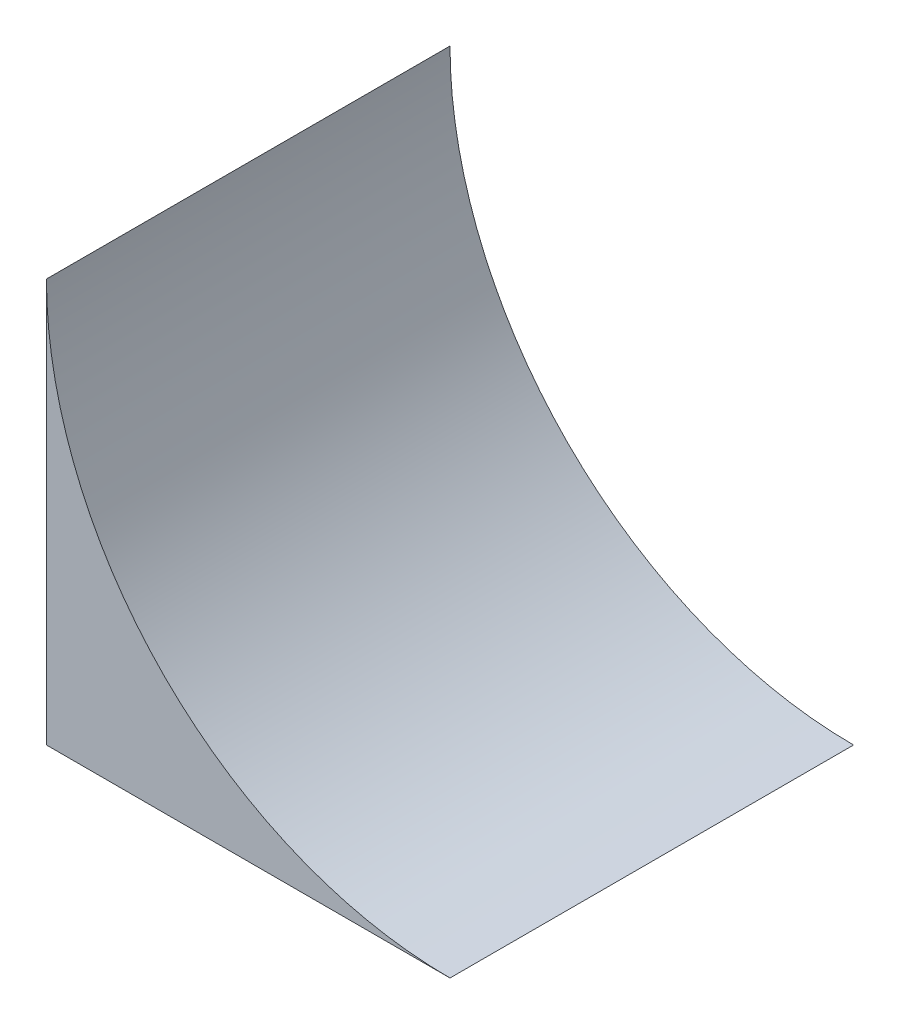
ISO-10303-21;
HEADER;
FILE_DESCRIPTION(('STEP AP214'),'2;1');
FILE_NAME('part.step','',(''),(''),'','','');
FILE_SCHEMA(('AUTOMOTIVE_DESIGN { 1 0 10303 214 1 1 1 1 }'));
ENDSEC;
DATA;
#1=APPLICATION_CONTEXT('core data for automotive mechanical design processes');
#2=APPLICATION_PROTOCOL_DEFINITION('international standard','automotive_design',2000,#1);
#3=PRODUCT_CONTEXT('',#1,'mechanical');
#4=PRODUCT('Part','Part','',(#3));
#5=PRODUCT_RELATED_PRODUCT_CATEGORY('part','',(#4));
#6=PRODUCT_DEFINITION_FORMATION('','',#4);
#7=PRODUCT_DEFINITION_CONTEXT('part definition',#1,'design');
#8=PRODUCT_DEFINITION('design','',#6,#7);
#9=PRODUCT_DEFINITION_SHAPE('','',#8);
#10=(LENGTH_UNIT() NAMED_UNIT(*) SI_UNIT(.MILLI.,.METRE.));
#11=(NAMED_UNIT(*) PLANE_ANGLE_UNIT() SI_UNIT($,.RADIAN.));
#12=(NAMED_UNIT(*) SI_UNIT($,.STERADIAN.) SOLID_ANGLE_UNIT());
#13=UNCERTAINTY_MEASURE_WITH_UNIT(LENGTH_MEASURE(1.E-05),#10,'distance_accuracy_value','');
#14=(GEOMETRIC_REPRESENTATION_CONTEXT(3) GLOBAL_UNCERTAINTY_ASSIGNED_CONTEXT((#13)) GLOBAL_UNIT_ASSIGNED_CONTEXT((#10,
#11,#12)) REPRESENTATION_CONTEXT('',''));
#15=CARTESIAN_POINT('',(0.,0.,0.));
#16=DIRECTION('',(0.,0.,1.));
#17=DIRECTION('',(1.,0.,0.));
#18=AXIS2_PLACEMENT_3D('',#15,#16,#17);
#19=CARTESIAN_POINT('',(0.,0.,6.));
#20=DIRECTION('',(1.,0.,0.));
#21=DIRECTION('',(0.,0.,-1.));
#22=AXIS2_PLACEMENT_3D('',#19,#20,#21);
#23=PLANE('',#22);
#24=DIRECTION('',(0.,-1.,0.));
#25=VECTOR('',#24,1.);
#26=CARTESIAN_POINT('',(0.,0.,0.));
#27=LINE('',#26,#25);
#28=CARTESIAN_POINT('',(0.,6.,0.));
#29=VERTEX_POINT('',#28);
#30=CARTESIAN_POINT('',(0.,0.,0.));
#31=VERTEX_POINT('',#30);
#32=EDGE_CURVE('E79',#29,#31,#27,.T.);
#33=ORIENTED_EDGE('',*,*,#32,.T.);
#34=DIRECTION('',(0.,0.,-1.));
#35=VECTOR('',#34,1.);
#36=CARTESIAN_POINT('',(0.,0.,6.));
#37=LINE('',#36,#35);
#38=CARTESIAN_POINT('',(0.,0.,6.));
#39=VERTEX_POINT('',#38);
#40=EDGE_CURVE('E11',#39,#31,#37,.T.);
#41=ORIENTED_EDGE('',*,*,#40,.F.);
#42=DIRECTION('',(0.,-1.,0.));
#43=VECTOR('',#42,1.);
#44=CARTESIAN_POINT('',(0.,0.,6.));
#45=LINE('',#44,#43);
#46=CARTESIAN_POINT('',(0.,6.,6.));
#47=VERTEX_POINT('',#46);
#48=EDGE_CURVE('E72',#47,#39,#45,.T.);
#49=ORIENTED_EDGE('',*,*,#48,.F.);
#50=DIRECTION('',(0.,0.,-1.));
#51=VECTOR('',#50,1.);
#52=CARTESIAN_POINT('',(0.,6.,6.));
#53=LINE('',#52,#51);
#54=EDGE_CURVE('E80',#47,#29,#53,.T.);
#55=ORIENTED_EDGE('',*,*,#54,.T.);
#56=EDGE_LOOP('',(#33,#41,#49,#55));
#57=FACE_BOUND('',#56,.T.);
#58=ADVANCED_FACE('F32',(#57),#23,.F.);
#59=CARTESIAN_POINT('',(0.,0.,6.));
#60=DIRECTION('',(0.,1.,0.));
#61=DIRECTION('',(0.,0.,1.));
#62=AXIS2_PLACEMENT_3D('',#59,#60,#61);
#63=PLANE('',#62);
#64=DIRECTION('',(1.,0.,0.));
#65=VECTOR('',#64,1.);
#66=CARTESIAN_POINT('',(0.,0.,0.));
#67=LINE('',#66,#65);
#68=CARTESIAN_POINT('',(6.,0.,0.));
#69=VERTEX_POINT('',#68);
#70=EDGE_CURVE('E60',#31,#69,#67,.T.);
#71=ORIENTED_EDGE('',*,*,#70,.T.);
#72=DIRECTION('',(0.,0.,-1.));
#73=VECTOR('',#72,1.);
#74=CARTESIAN_POINT('',(6.,0.,6.));
#75=LINE('',#74,#73);
#76=CARTESIAN_POINT('',(6.,0.,6.));
#77=VERTEX_POINT('',#76);
#78=EDGE_CURVE('E40',#77,#69,#75,.T.);
#79=ORIENTED_EDGE('',*,*,#78,.F.);
#80=DIRECTION('',(1.,0.,0.));
#81=VECTOR('',#80,1.);
#82=CARTESIAN_POINT('',(0.,0.,6.));
#83=LINE('',#82,#81);
#84=EDGE_CURVE('E68',#39,#77,#83,.T.);
#85=ORIENTED_EDGE('',*,*,#84,.F.);
#86=ORIENTED_EDGE('',*,*,#40,.T.);
#87=EDGE_LOOP('',(#71,#79,#85,#86));
#88=FACE_BOUND('',#87,.T.);
#89=ADVANCED_FACE('F69',(#88),#63,.F.);
#90=CARTESIAN_POINT('',(6.,6.,6.));
#91=DIRECTION('',(0.,0.,-1.));
#92=DIRECTION('',(-1.,0.,0.));
#93=AXIS2_PLACEMENT_3D('',#90,#91,#92);
#94=CYLINDRICAL_SURFACE('',#93,6.);
#95=CARTESIAN_POINT('',(6.,6.,0.));
#96=DIRECTION('',(0.,0.,-1.));
#97=DIRECTION('',(1.,0.,0.));
#98=AXIS2_PLACEMENT_3D('',#95,#96,#97);
#99=CIRCLE('',#98,6.);
#100=EDGE_CURVE('E65',#69,#29,#99,.T.);
#101=ORIENTED_EDGE('',*,*,#100,.T.);
#102=ORIENTED_EDGE('',*,*,#54,.F.);
#103=CARTESIAN_POINT('',(6.,6.,6.));
#104=DIRECTION('',(0.,0.,-1.));
#105=DIRECTION('',(1.,0.,0.));
#106=AXIS2_PLACEMENT_3D('',#103,#104,#105);
#107=CIRCLE('',#106,6.);
#108=EDGE_CURVE('E48',#77,#47,#107,.T.);
#109=ORIENTED_EDGE('',*,*,#108,.F.);
#110=ORIENTED_EDGE('',*,*,#78,.T.);
#111=EDGE_LOOP('',(#101,#102,#109,#110));
#112=FACE_BOUND('',#111,.T.);
#113=ADVANCED_FACE('F87',(#112),#94,.F.);
#114=CARTESIAN_POINT('',(6.,6.,6.));
#115=DIRECTION('',(0.,0.,1.));
#116=DIRECTION('',(1.,0.,0.));
#117=AXIS2_PLACEMENT_3D('',#114,#115,#116);
#118=PLANE('',#117);
#119=ORIENTED_EDGE('',*,*,#48,.T.);
#120=ORIENTED_EDGE('',*,*,#84,.T.);
#121=ORIENTED_EDGE('',*,*,#108,.T.);
#122=EDGE_LOOP('',(#119,#120,#121));
#123=FACE_BOUND('',#122,.T.);
#124=ADVANCED_FACE('F75',(#123),#118,.T.);
#125=CARTESIAN_POINT('',(6.,6.,0.));
#126=DIRECTION('',(0.,0.,1.));
#127=DIRECTION('',(1.,0.,0.));
#128=AXIS2_PLACEMENT_3D('',#125,#126,#127);
#129=PLANE('',#128);
#130=ORIENTED_EDGE('',*,*,#32,.F.);
#131=ORIENTED_EDGE('',*,*,#100,.F.);
#132=ORIENTED_EDGE('',*,*,#70,.F.);
#133=EDGE_LOOP('',(#130,#131,#132));
#134=FACE_BOUND('',#133,.T.);
#135=ADVANCED_FACE('F88',(#134),#129,.F.);
#136=CLOSED_SHELL('',(#58,#89,#113,#124,#135));
#137=MANIFOLD_SOLID_BREP('B2',#136);
#138=ADVANCED_BREP_SHAPE_REPRESENTATION('',(#18,#137),#14);
#139=SHAPE_DEFINITION_REPRESENTATION(#9,#138);
ENDSEC;
END-ISO-10303-21;
